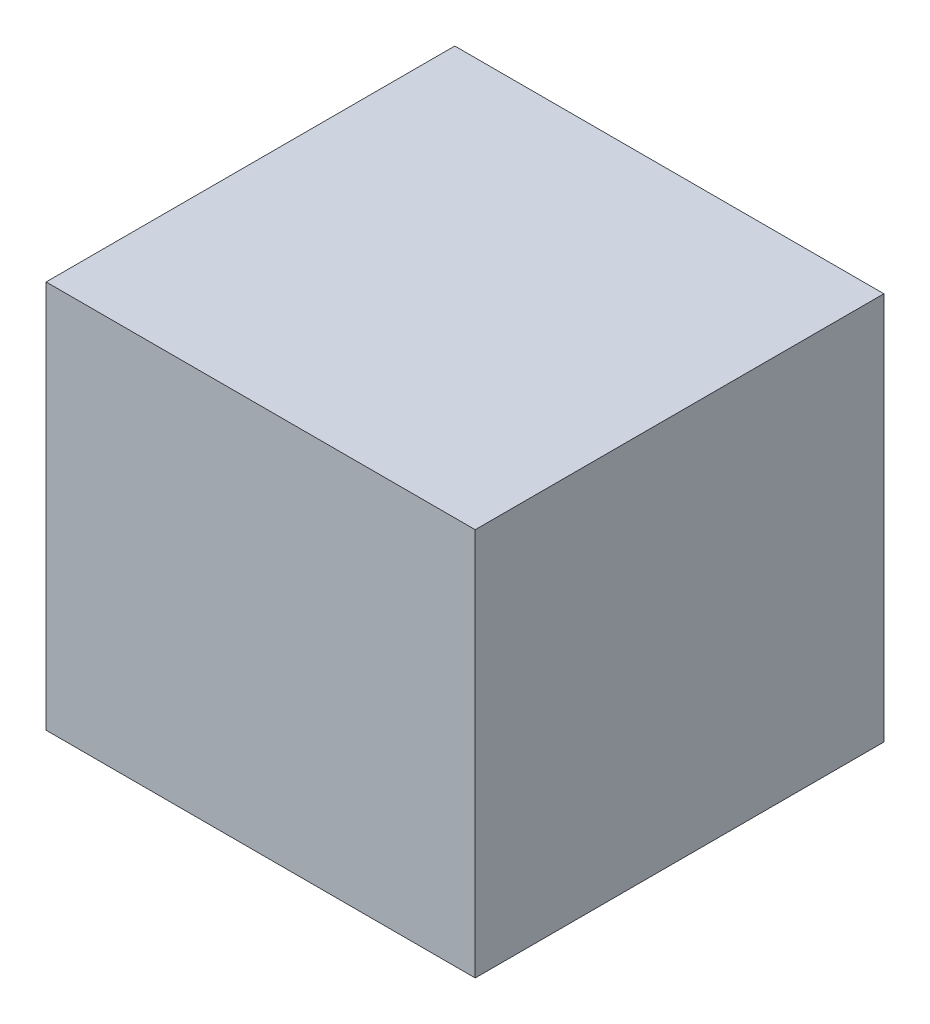
ISO-10303-21;
HEADER;
FILE_DESCRIPTION(('STEP AP214'),'2;1');
FILE_NAME('part.step','',(''),(''),'','','');
FILE_SCHEMA(('AUTOMOTIVE_DESIGN { 1 0 10303 214 1 1 1 1 }'));
ENDSEC;
DATA;
#1=APPLICATION_CONTEXT('core data for automotive mechanical design processes');
#2=APPLICATION_PROTOCOL_DEFINITION('international standard','automotive_design',2000,#1);
#3=PRODUCT_CONTEXT('',#1,'mechanical');
#4=PRODUCT('Part','Part','',(#3));
#5=PRODUCT_RELATED_PRODUCT_CATEGORY('part','',(#4));
#6=PRODUCT_DEFINITION_FORMATION('','',#4);
#7=PRODUCT_DEFINITION_CONTEXT('part definition',#1,'design');
#8=PRODUCT_DEFINITION('design','',#6,#7);
#9=PRODUCT_DEFINITION_SHAPE('','',#8);
#10=(LENGTH_UNIT() NAMED_UNIT(*) SI_UNIT(.MILLI.,.METRE.));
#11=(NAMED_UNIT(*) PLANE_ANGLE_UNIT() SI_UNIT($,.RADIAN.));
#12=(NAMED_UNIT(*) SI_UNIT($,.STERADIAN.) SOLID_ANGLE_UNIT());
#13=UNCERTAINTY_MEASURE_WITH_UNIT(LENGTH_MEASURE(1.E-05),#10,'distance_accuracy_value','');
#14=(GEOMETRIC_REPRESENTATION_CONTEXT(3) GLOBAL_UNCERTAINTY_ASSIGNED_CONTEXT((#13)) GLOBAL_UNIT_ASSIGNED_CONTEXT((#10,
#11,#12)) REPRESENTATION_CONTEXT('',''));
#15=CARTESIAN_POINT('',(0.,0.,0.));
#16=DIRECTION('',(0.,0.,1.));
#17=DIRECTION('',(1.,0.,0.));
#18=AXIS2_PLACEMENT_3D('',#15,#16,#17);
#19=CARTESIAN_POINT('',(0.52500022,-0.47499778,0.));
#20=DIRECTION('',(-1.,0.,0.));
#21=DIRECTION('',(0.,1.,0.));
#22=AXIS2_PLACEMENT_3D('',#19,#20,#21);
#23=PLANE('',#22);
#24=DIRECTION('',(0.,1.,0.));
#25=VECTOR('',#24,1.);
#26=CARTESIAN_POINT('',(0.52500022,-0.47499778,0.));
#27=LINE('',#26,#25);
#28=CARTESIAN_POINT('',(0.52500022,-0.47499778,0.));
#29=VERTEX_POINT('',#28);
#30=CARTESIAN_POINT('',(0.52500022,0.47500032,0.));
#31=VERTEX_POINT('',#30);
#32=EDGE_CURVE('E11',#29,#31,#27,.T.);
#33=ORIENTED_EDGE('',*,*,#32,.T.);
#34=DIRECTION('',(0.,0.,1.));
#35=VECTOR('',#34,1.);
#36=CARTESIAN_POINT('',(0.52500022,0.47500032,0.));
#37=LINE('',#36,#35);
#38=CARTESIAN_POINT('',(0.52500022,0.47500032,1.00000054));
#39=VERTEX_POINT('',#38);
#40=EDGE_CURVE('E23',#31,#39,#37,.T.);
#41=ORIENTED_EDGE('',*,*,#40,.T.);
#42=DIRECTION('',(0.,1.,0.));
#43=VECTOR('',#42,1.);
#44=CARTESIAN_POINT('',(0.52500022,-0.47499778,1.00000054));
#45=LINE('',#44,#43);
#46=CARTESIAN_POINT('',(0.52500022,-0.47499778,1.00000054));
#47=VERTEX_POINT('',#46);
#48=EDGE_CURVE('E86',#47,#39,#45,.T.);
#49=ORIENTED_EDGE('',*,*,#48,.F.);
#50=DIRECTION('',(0.,0.,1.));
#51=VECTOR('',#50,1.);
#52=CARTESIAN_POINT('',(0.52500022,-0.47499778,0.));
#53=LINE('',#52,#51);
#54=EDGE_CURVE('E35',#29,#47,#53,.T.);
#55=ORIENTED_EDGE('',*,*,#54,.F.);
#56=EDGE_LOOP('',(#33,#41,#49,#55));
#57=FACE_BOUND('',#56,.T.);
#58=ADVANCED_FACE('F16',(#57),#23,.F.);
#59=CARTESIAN_POINT('',(0.52500022,0.47500032,0.));
#60=DIRECTION('',(0.,-1.,0.));
#61=DIRECTION('',(-1.,0.,0.));
#62=AXIS2_PLACEMENT_3D('',#59,#60,#61);
#63=PLANE('',#62);
#64=DIRECTION('',(-1.,0.,0.));
#65=VECTOR('',#64,1.);
#66=CARTESIAN_POINT('',(0.52500022,0.47500032,0.));
#67=LINE('',#66,#65);
#68=CARTESIAN_POINT('',(-0.52500022,0.47500032,0.));
#69=VERTEX_POINT('',#68);
#70=EDGE_CURVE('E83',#31,#69,#67,.T.);
#71=ORIENTED_EDGE('',*,*,#70,.T.);
#72=DIRECTION('',(0.,0.,1.));
#73=VECTOR('',#72,1.);
#74=CARTESIAN_POINT('',(-0.52500022,0.47500032,0.));
#75=LINE('',#74,#73);
#76=CARTESIAN_POINT('',(-0.52500022,0.47500032,1.00000054));
#77=VERTEX_POINT('',#76);
#78=EDGE_CURVE('E81',#69,#77,#75,.T.);
#79=ORIENTED_EDGE('',*,*,#78,.T.);
#80=DIRECTION('',(-1.,0.,0.));
#81=VECTOR('',#80,1.);
#82=CARTESIAN_POINT('',(0.52500022,0.47500032,1.00000054));
#83=LINE('',#82,#81);
#84=EDGE_CURVE('E61',#39,#77,#83,.T.);
#85=ORIENTED_EDGE('',*,*,#84,.F.);
#86=ORIENTED_EDGE('',*,*,#40,.F.);
#87=EDGE_LOOP('',(#71,#79,#85,#86));
#88=FACE_BOUND('',#87,.T.);
#89=ADVANCED_FACE('F88',(#88),#63,.F.);
#90=CARTESIAN_POINT('',(-0.52500022,0.47500032,0.));
#91=DIRECTION('',(1.,0.,0.));
#92=DIRECTION('',(0.,-1.,0.));
#93=AXIS2_PLACEMENT_3D('',#90,#91,#92);
#94=PLANE('',#93);
#95=DIRECTION('',(0.,-1.,0.));
#96=VECTOR('',#95,1.);
#97=CARTESIAN_POINT('',(-0.52500022,0.47500032,0.));
#98=LINE('',#97,#96);
#99=CARTESIAN_POINT('',(-0.52500022,-0.47499778,0.));
#100=VERTEX_POINT('',#99);
#101=EDGE_CURVE('E70',#69,#100,#98,.T.);
#102=ORIENTED_EDGE('',*,*,#101,.T.);
#103=DIRECTION('',(0.,0.,1.));
#104=VECTOR('',#103,1.);
#105=CARTESIAN_POINT('',(-0.52500022,-0.47499778,0.));
#106=LINE('',#105,#104);
#107=CARTESIAN_POINT('',(-0.52500022,-0.47499778,1.00000054));
#108=VERTEX_POINT('',#107);
#109=EDGE_CURVE('E64',#100,#108,#106,.T.);
#110=ORIENTED_EDGE('',*,*,#109,.T.);
#111=DIRECTION('',(0.,-1.,0.));
#112=VECTOR('',#111,1.);
#113=CARTESIAN_POINT('',(-0.52500022,0.47500032,1.00000054));
#114=LINE('',#113,#112);
#115=EDGE_CURVE('E56',#77,#108,#114,.T.);
#116=ORIENTED_EDGE('',*,*,#115,.F.);
#117=ORIENTED_EDGE('',*,*,#78,.F.);
#118=EDGE_LOOP('',(#102,#110,#116,#117));
#119=FACE_BOUND('',#118,.T.);
#120=ADVANCED_FACE('F68',(#119),#94,.F.);
#121=CARTESIAN_POINT('',(-0.52500022,-0.47499778,0.));
#122=DIRECTION('',(0.,1.,0.));
#123=DIRECTION('',(1.,0.,0.));
#124=AXIS2_PLACEMENT_3D('',#121,#122,#123);
#125=PLANE('',#124);
#126=DIRECTION('',(1.,0.,0.));
#127=VECTOR('',#126,1.);
#128=CARTESIAN_POINT('',(-0.52500022,-0.47499778,0.));
#129=LINE('',#128,#127);
#130=EDGE_CURVE('E65',#100,#29,#129,.T.);
#131=ORIENTED_EDGE('',*,*,#130,.T.);
#132=ORIENTED_EDGE('',*,*,#54,.T.);
#133=DIRECTION('',(1.,0.,0.));
#134=VECTOR('',#133,1.);
#135=CARTESIAN_POINT('',(-0.52500022,-0.47499778,1.00000054));
#136=LINE('',#135,#134);
#137=EDGE_CURVE('E60',#108,#47,#136,.T.);
#138=ORIENTED_EDGE('',*,*,#137,.F.);
#139=ORIENTED_EDGE('',*,*,#109,.F.);
#140=EDGE_LOOP('',(#131,#132,#138,#139));
#141=FACE_BOUND('',#140,.T.);
#142=ADVANCED_FACE('F75',(#141),#125,.F.);
#143=CARTESIAN_POINT('',(0.52500022,-0.47499778,0.));
#144=DIRECTION('',(0.,0.,-1.));
#145=DIRECTION('',(-1.,0.,0.));
#146=AXIS2_PLACEMENT_3D('',#143,#144,#145);
#147=PLANE('',#146);
#148=ORIENTED_EDGE('',*,*,#130,.F.);
#149=ORIENTED_EDGE('',*,*,#101,.F.);
#150=ORIENTED_EDGE('',*,*,#70,.F.);
#151=ORIENTED_EDGE('',*,*,#32,.F.);
#152=EDGE_LOOP('',(#148,#149,#150,#151));
#153=FACE_BOUND('',#152,.T.);
#154=ADVANCED_FACE('F90',(#153),#147,.T.);
#155=CARTESIAN_POINT('',(0.52500022,-0.47499778,1.00000054));
#156=DIRECTION('',(0.,0.,-1.));
#157=DIRECTION('',(-1.,0.,0.));
#158=AXIS2_PLACEMENT_3D('',#155,#156,#157);
#159=PLANE('',#158);
#160=ORIENTED_EDGE('',*,*,#48,.T.);
#161=ORIENTED_EDGE('',*,*,#84,.T.);
#162=ORIENTED_EDGE('',*,*,#115,.T.);
#163=ORIENTED_EDGE('',*,*,#137,.T.);
#164=EDGE_LOOP('',(#160,#161,#162,#163));
#165=FACE_BOUND('',#164,.T.);
#166=ADVANCED_FACE('F58',(#165),#159,.F.);
#167=CLOSED_SHELL('',(#58,#89,#120,#142,#154,#166));
#168=MANIFOLD_SOLID_BREP('B1',#167);
#169=ADVANCED_BREP_SHAPE_REPRESENTATION('',(#18,#168),#14);
#170=SHAPE_DEFINITION_REPRESENTATION(#9,#169);
ENDSEC;
END-ISO-10303-21;
